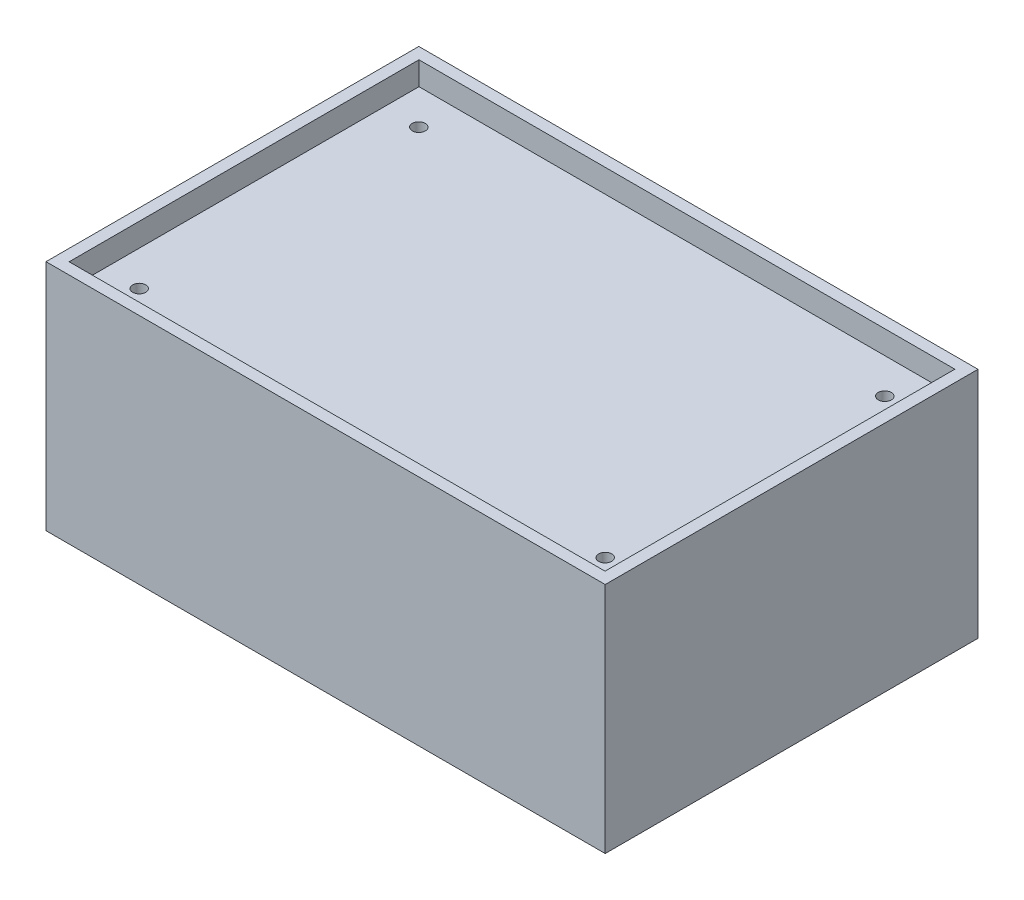
ISO-10303-21;
HEADER;
FILE_DESCRIPTION(('STEP AP214'),'2;1');
FILE_NAME('part.step','',(''),(''),'','','');
FILE_SCHEMA(('AUTOMOTIVE_DESIGN { 1 0 10303 214 1 1 1 1 }'));
ENDSEC;
DATA;
#1=APPLICATION_CONTEXT('core data for automotive mechanical design processes');
#2=APPLICATION_PROTOCOL_DEFINITION('international standard','automotive_design',2000,#1);
#3=PRODUCT_CONTEXT('',#1,'mechanical');
#4=PRODUCT('Part','Part','',(#3));
#5=PRODUCT_RELATED_PRODUCT_CATEGORY('part','',(#4));
#6=PRODUCT_DEFINITION_FORMATION('','',#4);
#7=PRODUCT_DEFINITION_CONTEXT('part definition',#1,'design');
#8=PRODUCT_DEFINITION('design','',#6,#7);
#9=PRODUCT_DEFINITION_SHAPE('','',#8);
#10=(LENGTH_UNIT() NAMED_UNIT(*) SI_UNIT(.MILLI.,.METRE.));
#11=(NAMED_UNIT(*) PLANE_ANGLE_UNIT() SI_UNIT($,.RADIAN.));
#12=(NAMED_UNIT(*) SI_UNIT($,.STERADIAN.) SOLID_ANGLE_UNIT());
#13=UNCERTAINTY_MEASURE_WITH_UNIT(LENGTH_MEASURE(1.E-05),#10,'distance_accuracy_value','');
#14=(GEOMETRIC_REPRESENTATION_CONTEXT(3) GLOBAL_UNCERTAINTY_ASSIGNED_CONTEXT((#13)) GLOBAL_UNIT_ASSIGNED_CONTEXT((#10,
#11,#12)) REPRESENTATION_CONTEXT('',''));
#15=CARTESIAN_POINT('',(0.,0.,0.));
#16=DIRECTION('',(0.,0.,1.));
#17=DIRECTION('',(1.,0.,0.));
#18=AXIS2_PLACEMENT_3D('',#15,#16,#17);
#19=CARTESIAN_POINT('',(-76.2,-31.75,-101.6));
#20=DIRECTION('',(0.,-1.,0.));
#21=DIRECTION('',(0.,0.,-1.));
#22=AXIS2_PLACEMENT_3D('',#19,#20,#21);
#23=PLANE('',#22);
#24=DIRECTION('',(1.,0.,0.));
#25=VECTOR('',#24,1.);
#26=CARTESIAN_POINT('',(-76.2,-31.75,0.));
#27=LINE('',#26,#25);
#28=CARTESIAN_POINT('',(-76.2,-31.75,0.));
#29=VERTEX_POINT('',#28);
#30=CARTESIAN_POINT('',(76.2,-31.75,0.));
#31=VERTEX_POINT('',#30);
#32=EDGE_CURVE('E200',#29,#31,#27,.T.);
#33=ORIENTED_EDGE('',*,*,#32,.F.);
#34=DIRECTION('',(0.,0.,1.));
#35=VECTOR('',#34,1.);
#36=CARTESIAN_POINT('',(-76.2,-31.75,-101.6));
#37=LINE('',#36,#35);
#38=CARTESIAN_POINT('',(-76.2,-31.75,-101.6));
#39=VERTEX_POINT('',#38);
#40=EDGE_CURVE('E42',#39,#29,#37,.T.);
#41=ORIENTED_EDGE('',*,*,#40,.F.);
#42=DIRECTION('',(1.,0.,0.));
#43=VECTOR('',#42,1.);
#44=CARTESIAN_POINT('',(-76.2,-31.75,-101.6));
#45=LINE('',#44,#43);
#46=CARTESIAN_POINT('',(76.2,-31.75,-101.6));
#47=VERTEX_POINT('',#46);
#48=EDGE_CURVE('E206',#39,#47,#45,.T.);
#49=ORIENTED_EDGE('',*,*,#48,.T.);
#50=DIRECTION('',(0.,0.,1.));
#51=VECTOR('',#50,1.);
#52=CARTESIAN_POINT('',(76.2,-31.75,-101.6));
#53=LINE('',#52,#51);
#54=EDGE_CURVE('E11',#47,#31,#53,.T.);
#55=ORIENTED_EDGE('',*,*,#54,.T.);
#56=EDGE_LOOP('',(#33,#41,#49,#55));
#57=FACE_BOUND('',#56,.T.);
#58=DIRECTION('',(-1.,0.,0.));
#59=VECTOR('',#58,1.);
#60=CARTESIAN_POINT('',(-73.025,-31.75,-98.47));
#61=LINE('',#60,#59);
#62=CARTESIAN_POINT('',(73.025,-31.75,-98.47));
#63=VERTEX_POINT('',#62);
#64=CARTESIAN_POINT('',(-73.025,-31.75,-98.47));
#65=VERTEX_POINT('',#64);
#66=EDGE_CURVE('E155',#63,#65,#61,.T.);
#67=ORIENTED_EDGE('',*,*,#66,.T.);
#68=DIRECTION('',(0.,0.,1.));
#69=VECTOR('',#68,1.);
#70=CARTESIAN_POINT('',(-73.025,-31.75,-98.47));
#71=LINE('',#70,#69);
#72=CARTESIAN_POINT('',(-73.025,-31.75,-3.12999999999999));
#73=VERTEX_POINT('',#72);
#74=EDGE_CURVE('E50',#65,#73,#71,.T.);
#75=ORIENTED_EDGE('',*,*,#74,.T.);
#76=DIRECTION('',(1.,0.,0.));
#77=VECTOR('',#76,1.);
#78=CARTESIAN_POINT('',(-73.025,-31.75,-3.12999999999999));
#79=LINE('',#78,#77);
#80=CARTESIAN_POINT('',(73.025,-31.75,-3.12999999999998));
#81=VERTEX_POINT('',#80);
#82=EDGE_CURVE('E143',#73,#81,#79,.T.);
#83=ORIENTED_EDGE('',*,*,#82,.T.);
#84=DIRECTION('',(0.,0.,-1.));
#85=VECTOR('',#84,1.);
#86=CARTESIAN_POINT('',(73.025,-31.75,-98.47));
#87=LINE('',#86,#85);
#88=EDGE_CURVE('E146',#81,#63,#87,.T.);
#89=ORIENTED_EDGE('',*,*,#88,.T.);
#90=EDGE_LOOP('',(#67,#75,#83,#89));
#91=FACE_BOUND('',#90,.T.);
#92=ADVANCED_FACE('F33',(#57,#91),#23,.T.);
#93=CARTESIAN_POINT('',(76.2,31.75,-101.6));
#94=DIRECTION('',(1.,0.,0.));
#95=DIRECTION('',(0.,1.,0.));
#96=AXIS2_PLACEMENT_3D('',#93,#94,#95);
#97=PLANE('',#96);
#98=DIRECTION('',(0.,1.,0.));
#99=VECTOR('',#98,1.);
#100=CARTESIAN_POINT('',(76.2,31.75,0.));
#101=LINE('',#100,#99);
#102=CARTESIAN_POINT('',(76.2,31.75,0.));
#103=VERTEX_POINT('',#102);
#104=EDGE_CURVE('E190',#31,#103,#101,.T.);
#105=ORIENTED_EDGE('',*,*,#104,.F.);
#106=ORIENTED_EDGE('',*,*,#54,.F.);
#107=DIRECTION('',(0.,1.,0.));
#108=VECTOR('',#107,1.);
#109=CARTESIAN_POINT('',(76.2,31.75,-101.6));
#110=LINE('',#109,#108);
#111=CARTESIAN_POINT('',(76.2,31.75,-101.6));
#112=VERTEX_POINT('',#111);
#113=EDGE_CURVE('E196',#47,#112,#110,.T.);
#114=ORIENTED_EDGE('',*,*,#113,.T.);
#115=DIRECTION('',(0.,0.,1.));
#116=VECTOR('',#115,1.);
#117=CARTESIAN_POINT('',(76.2,31.75,-101.6));
#118=LINE('',#117,#116);
#119=EDGE_CURVE('E37',#112,#103,#118,.T.);
#120=ORIENTED_EDGE('',*,*,#119,.T.);
#121=EDGE_LOOP('',(#105,#106,#114,#120));
#122=FACE_BOUND('',#121,.T.);
#123=ADVANCED_FACE('F35',(#122),#97,.T.);
#124=CARTESIAN_POINT('',(-76.2,31.75,-101.6));
#125=DIRECTION('',(-1.,0.,0.));
#126=DIRECTION('',(0.,0.,1.));
#127=AXIS2_PLACEMENT_3D('',#124,#125,#126);
#128=PLANE('',#127);
#129=DIRECTION('',(0.,-1.,0.));
#130=VECTOR('',#129,1.);
#131=CARTESIAN_POINT('',(-76.2,31.75,0.));
#132=LINE('',#131,#130);
#133=CARTESIAN_POINT('',(-76.2,31.75,0.));
#134=VERTEX_POINT('',#133);
#135=EDGE_CURVE('E214',#134,#29,#132,.T.);
#136=ORIENTED_EDGE('',*,*,#135,.F.);
#137=DIRECTION('',(0.,0.,1.));
#138=VECTOR('',#137,1.);
#139=CARTESIAN_POINT('',(-76.2,31.75,-101.6));
#140=LINE('',#139,#138);
#141=CARTESIAN_POINT('',(-76.2,31.75,-101.6));
#142=VERTEX_POINT('',#141);
#143=EDGE_CURVE('E219',#142,#134,#140,.T.);
#144=ORIENTED_EDGE('',*,*,#143,.F.);
#145=DIRECTION('',(0.,-1.,0.));
#146=VECTOR('',#145,1.);
#147=CARTESIAN_POINT('',(-76.2,31.75,-101.6));
#148=LINE('',#147,#146);
#149=EDGE_CURVE('E203',#142,#39,#148,.T.);
#150=ORIENTED_EDGE('',*,*,#149,.T.);
#151=ORIENTED_EDGE('',*,*,#40,.T.);
#152=EDGE_LOOP('',(#136,#144,#150,#151));
#153=FACE_BOUND('',#152,.T.);
#154=ADVANCED_FACE('F238',(#153),#128,.T.);
#155=CARTESIAN_POINT('',(-76.2,31.75,-101.6));
#156=DIRECTION('',(0.,1.,0.));
#157=DIRECTION('',(0.,0.,1.));
#158=AXIS2_PLACEMENT_3D('',#155,#156,#157);
#159=PLANE('',#158);
#160=DIRECTION('',(0.,0.,1.));
#161=VECTOR('',#160,1.);
#162=CARTESIAN_POINT('',(-73.025,31.75,-98.47));
#163=LINE('',#162,#161);
#164=CARTESIAN_POINT('',(-73.025,31.75,-98.47));
#165=VERTEX_POINT('',#164);
#166=CARTESIAN_POINT('',(-73.025,31.75,-3.12999999999999));
#167=VERTEX_POINT('',#166);
#168=EDGE_CURVE('E58',#165,#167,#163,.T.);
#169=ORIENTED_EDGE('',*,*,#168,.F.);
#170=DIRECTION('',(-1.,0.,0.));
#171=VECTOR('',#170,1.);
#172=CARTESIAN_POINT('',(-73.025,31.75,-98.47));
#173=LINE('',#172,#171);
#174=CARTESIAN_POINT('',(73.025,31.75,-98.47));
#175=VERTEX_POINT('',#174);
#176=EDGE_CURVE('E169',#175,#165,#173,.T.);
#177=ORIENTED_EDGE('',*,*,#176,.F.);
#178=DIRECTION('',(0.,0.,-1.));
#179=VECTOR('',#178,1.);
#180=CARTESIAN_POINT('',(73.025,31.75,-98.47));
#181=LINE('',#180,#179);
#182=CARTESIAN_POINT('',(73.025,31.75,-3.12999999999998));
#183=VERTEX_POINT('',#182);
#184=EDGE_CURVE('E183',#183,#175,#181,.T.);
#185=ORIENTED_EDGE('',*,*,#184,.F.);
#186=DIRECTION('',(1.,0.,0.));
#187=VECTOR('',#186,1.);
#188=CARTESIAN_POINT('',(-73.025,31.75,-3.12999999999999));
#189=LINE('',#188,#187);
#190=EDGE_CURVE('E180',#167,#183,#189,.T.);
#191=ORIENTED_EDGE('',*,*,#190,.F.);
#192=EDGE_LOOP('',(#169,#177,#185,#191));
#193=FACE_BOUND('',#192,.T.);
#194=DIRECTION('',(-1.,0.,0.));
#195=VECTOR('',#194,1.);
#196=CARTESIAN_POINT('',(-76.2,31.75,0.));
#197=LINE('',#196,#195);
#198=EDGE_CURVE('E211',#103,#134,#197,.T.);
#199=ORIENTED_EDGE('',*,*,#198,.F.);
#200=ORIENTED_EDGE('',*,*,#119,.F.);
#201=DIRECTION('',(-1.,0.,0.));
#202=VECTOR('',#201,1.);
#203=CARTESIAN_POINT('',(-76.2,31.75,-101.6));
#204=LINE('',#203,#202);
#205=EDGE_CURVE('E199',#112,#142,#204,.T.);
#206=ORIENTED_EDGE('',*,*,#205,.T.);
#207=ORIENTED_EDGE('',*,*,#143,.T.);
#208=EDGE_LOOP('',(#199,#200,#206,#207));
#209=FACE_BOUND('',#208,.T.);
#210=ADVANCED_FACE('F227',(#193,#209),#159,.T.);
#211=CARTESIAN_POINT('',(0.,0.,-101.6));
#212=DIRECTION('',(0.,0.,1.));
#213=DIRECTION('',(1.,0.,0.));
#214=AXIS2_PLACEMENT_3D('',#211,#212,#213);
#215=PLANE('',#214);
#216=ORIENTED_EDGE('',*,*,#113,.F.);
#217=ORIENTED_EDGE('',*,*,#48,.F.);
#218=ORIENTED_EDGE('',*,*,#149,.F.);
#219=ORIENTED_EDGE('',*,*,#205,.F.);
#220=EDGE_LOOP('',(#216,#217,#218,#219));
#221=FACE_BOUND('',#220,.T.);
#222=ADVANCED_FACE('F235',(#221),#215,.F.);
#223=CARTESIAN_POINT('',(0.,0.,0.));
#224=DIRECTION('',(0.,0.,1.));
#225=DIRECTION('',(1.,0.,0.));
#226=AXIS2_PLACEMENT_3D('',#223,#224,#225);
#227=PLANE('',#226);
#228=ORIENTED_EDGE('',*,*,#104,.T.);
#229=ORIENTED_EDGE('',*,*,#198,.T.);
#230=ORIENTED_EDGE('',*,*,#135,.T.);
#231=ORIENTED_EDGE('',*,*,#32,.T.);
#232=EDGE_LOOP('',(#228,#229,#230,#231));
#233=FACE_BOUND('',#232,.T.);
#234=ADVANCED_FACE('F229',(#233),#227,.T.);
#235=CARTESIAN_POINT('',(-73.025,25.4,-98.47));
#236=DIRECTION('',(-1.,0.,0.));
#237=DIRECTION('',(0.,0.,1.));
#238=AXIS2_PLACEMENT_3D('',#235,#236,#237);
#239=PLANE('',#238);
#240=ORIENTED_EDGE('',*,*,#168,.T.);
#241=DIRECTION('',(0.,1.,0.));
#242=VECTOR('',#241,1.);
#243=CARTESIAN_POINT('',(-73.025,25.4,-3.12999999999999));
#244=LINE('',#243,#242);
#245=CARTESIAN_POINT('',(-73.025,25.4,-3.12999999999999));
#246=VERTEX_POINT('',#245);
#247=EDGE_CURVE('E178',#246,#167,#244,.T.);
#248=ORIENTED_EDGE('',*,*,#247,.F.);
#249=DIRECTION('',(0.,0.,1.));
#250=VECTOR('',#249,1.);
#251=CARTESIAN_POINT('',(-73.025,25.4,-98.47));
#252=LINE('',#251,#250);
#253=CARTESIAN_POINT('',(-73.025,25.4,-98.47));
#254=VERTEX_POINT('',#253);
#255=EDGE_CURVE('E165',#254,#246,#252,.T.);
#256=ORIENTED_EDGE('',*,*,#255,.F.);
#257=DIRECTION('',(0.,1.,0.));
#258=VECTOR('',#257,1.);
#259=CARTESIAN_POINT('',(-73.025,25.4,-98.47));
#260=LINE('',#259,#258);
#261=EDGE_CURVE('E188',#254,#165,#260,.T.);
#262=ORIENTED_EDGE('',*,*,#261,.T.);
#263=EDGE_LOOP('',(#240,#248,#256,#262));
#264=FACE_BOUND('',#263,.T.);
#265=ADVANCED_FACE('F253',(#264),#239,.F.);
#266=CARTESIAN_POINT('',(-73.025,25.4,-98.47));
#267=DIRECTION('',(0.,0.,-1.));
#268=DIRECTION('',(-1.,0.,0.));
#269=AXIS2_PLACEMENT_3D('',#266,#267,#268);
#270=PLANE('',#269);
#271=ORIENTED_EDGE('',*,*,#176,.T.);
#272=ORIENTED_EDGE('',*,*,#261,.F.);
#273=DIRECTION('',(-1.,0.,0.));
#274=VECTOR('',#273,1.);
#275=CARTESIAN_POINT('',(-73.025,25.4,-98.47));
#276=LINE('',#275,#274);
#277=CARTESIAN_POINT('',(73.025,25.4,-98.47));
#278=VERTEX_POINT('',#277);
#279=EDGE_CURVE('E175',#278,#254,#276,.T.);
#280=ORIENTED_EDGE('',*,*,#279,.F.);
#281=DIRECTION('',(0.,1.,0.));
#282=VECTOR('',#281,1.);
#283=CARTESIAN_POINT('',(73.025,25.4,-98.47));
#284=LINE('',#283,#282);
#285=EDGE_CURVE('E191',#278,#175,#284,.T.);
#286=ORIENTED_EDGE('',*,*,#285,.T.);
#287=EDGE_LOOP('',(#271,#272,#280,#286));
#288=FACE_BOUND('',#287,.T.);
#289=ADVANCED_FACE('F258',(#288),#270,.F.);
#290=CARTESIAN_POINT('',(73.025,25.4,-98.47));
#291=DIRECTION('',(1.,0.,0.));
#292=DIRECTION('',(0.,0.,-1.));
#293=AXIS2_PLACEMENT_3D('',#290,#291,#292);
#294=PLANE('',#293);
#295=ORIENTED_EDGE('',*,*,#184,.T.);
#296=ORIENTED_EDGE('',*,*,#285,.F.);
#297=DIRECTION('',(0.,0.,-1.));
#298=VECTOR('',#297,1.);
#299=CARTESIAN_POINT('',(73.025,25.4,-98.47));
#300=LINE('',#299,#298);
#301=CARTESIAN_POINT('',(73.025,25.4,-3.12999999999998));
#302=VERTEX_POINT('',#301);
#303=EDGE_CURVE('E172',#302,#278,#300,.T.);
#304=ORIENTED_EDGE('',*,*,#303,.F.);
#305=DIRECTION('',(0.,1.,0.));
#306=VECTOR('',#305,1.);
#307=CARTESIAN_POINT('',(73.025,25.4,-3.12999999999998));
#308=LINE('',#307,#306);
#309=EDGE_CURVE('E193',#302,#183,#308,.T.);
#310=ORIENTED_EDGE('',*,*,#309,.T.);
#311=EDGE_LOOP('',(#295,#296,#304,#310));
#312=FACE_BOUND('',#311,.T.);
#313=ADVANCED_FACE('F263',(#312),#294,.F.);
#314=CARTESIAN_POINT('',(-73.025,25.4,-3.12999999999999));
#315=DIRECTION('',(0.,0.,1.));
#316=DIRECTION('',(1.,0.,0.));
#317=AXIS2_PLACEMENT_3D('',#314,#315,#316);
#318=PLANE('',#317);
#319=ORIENTED_EDGE('',*,*,#190,.T.);
#320=ORIENTED_EDGE('',*,*,#309,.F.);
#321=DIRECTION('',(1.,0.,0.));
#322=VECTOR('',#321,1.);
#323=CARTESIAN_POINT('',(-73.025,25.4,-3.12999999999999));
#324=LINE('',#323,#322);
#325=EDGE_CURVE('E168',#246,#302,#324,.T.);
#326=ORIENTED_EDGE('',*,*,#325,.F.);
#327=ORIENTED_EDGE('',*,*,#247,.T.);
#328=EDGE_LOOP('',(#319,#320,#326,#327));
#329=FACE_BOUND('',#328,.T.);
#330=ADVANCED_FACE('F259',(#329),#318,.F.);
#331=CARTESIAN_POINT('',(0.,25.4,0.));
#332=DIRECTION('',(0.,1.,0.));
#333=DIRECTION('',(0.,0.,1.));
#334=AXIS2_PLACEMENT_3D('',#331,#332,#333);
#335=PLANE('',#334);
#336=CARTESIAN_POINT('',(-63.5,25.4,-12.7));
#337=DIRECTION('',(0.,1.,0.));
#338=DIRECTION('',(0.,0.,1.));
#339=AXIS2_PLACEMENT_3D('',#336,#337,#338);
#340=CIRCLE('',#339,1.78);
#341=CARTESIAN_POINT('',(-63.5,25.4,-10.92));
#342=VERTEX_POINT('',#341);
#343=EDGE_CURVE('E325',#342,#342,#340,.T.);
#344=ORIENTED_EDGE('',*,*,#343,.F.);
#345=EDGE_LOOP('',(#344));
#346=FACE_BOUND('',#345,.T.);
#347=CARTESIAN_POINT('',(-63.5,25.4,-88.9));
#348=DIRECTION('',(0.,1.,0.));
#349=DIRECTION('',(0.,0.,1.));
#350=AXIS2_PLACEMENT_3D('',#347,#348,#349);
#351=CIRCLE('',#350,1.78);
#352=CARTESIAN_POINT('',(-63.5,25.4,-87.12));
#353=VERTEX_POINT('',#352);
#354=EDGE_CURVE('E324',#353,#353,#351,.T.);
#355=ORIENTED_EDGE('',*,*,#354,.F.);
#356=EDGE_LOOP('',(#355));
#357=FACE_BOUND('',#356,.T.);
#358=CARTESIAN_POINT('',(63.5,25.4,-12.7));
#359=DIRECTION('',(0.,1.,0.));
#360=DIRECTION('',(0.,0.,1.));
#361=AXIS2_PLACEMENT_3D('',#358,#359,#360);
#362=CIRCLE('',#361,1.78);
#363=CARTESIAN_POINT('',(63.5,25.4,-10.92));
#364=VERTEX_POINT('',#363);
#365=EDGE_CURVE('E334',#364,#364,#362,.T.);
#366=ORIENTED_EDGE('',*,*,#365,.F.);
#367=EDGE_LOOP('',(#366));
#368=FACE_BOUND('',#367,.T.);
#369=CARTESIAN_POINT('',(63.5,25.4,-88.9));
#370=DIRECTION('',(0.,1.,0.));
#371=DIRECTION('',(0.,0.,1.));
#372=AXIS2_PLACEMENT_3D('',#369,#370,#371);
#373=CIRCLE('',#372,1.78);
#374=CARTESIAN_POINT('',(63.5,25.4,-87.12));
#375=VERTEX_POINT('',#374);
#376=EDGE_CURVE('E149',#375,#375,#373,.T.);
#377=ORIENTED_EDGE('',*,*,#376,.F.);
#378=EDGE_LOOP('',(#377));
#379=FACE_BOUND('',#378,.T.);
#380=ORIENTED_EDGE('',*,*,#255,.T.);
#381=ORIENTED_EDGE('',*,*,#325,.T.);
#382=ORIENTED_EDGE('',*,*,#303,.T.);
#383=ORIENTED_EDGE('',*,*,#279,.T.);
#384=EDGE_LOOP('',(#380,#381,#382,#383));
#385=FACE_BOUND('',#384,.T.);
#386=ADVANCED_FACE('F262',(#346,#357,#368,#379,#385),#335,.T.);
#387=CARTESIAN_POINT('',(-73.025,-25.4,-98.47));
#388=DIRECTION('',(1.,0.,0.));
#389=DIRECTION('',(0.,0.,-1.));
#390=AXIS2_PLACEMENT_3D('',#387,#388,#389);
#391=PLANE('',#390);
#392=ORIENTED_EDGE('',*,*,#74,.F.);
#393=DIRECTION('',(0.,-1.,0.));
#394=VECTOR('',#393,1.);
#395=CARTESIAN_POINT('',(-73.025,-25.4,-98.47));
#396=LINE('',#395,#394);
#397=CARTESIAN_POINT('',(-73.025,-25.4,-98.47));
#398=VERTEX_POINT('',#397);
#399=EDGE_CURVE('E128',#398,#65,#396,.T.);
#400=ORIENTED_EDGE('',*,*,#399,.F.);
#401=DIRECTION('',(0.,0.,1.));
#402=VECTOR('',#401,1.);
#403=CARTESIAN_POINT('',(-73.025,-25.4,-98.47));
#404=LINE('',#403,#402);
#405=CARTESIAN_POINT('',(-73.025,-25.4,-3.12999999999999));
#406=VERTEX_POINT('',#405);
#407=EDGE_CURVE('E135',#398,#406,#404,.T.);
#408=ORIENTED_EDGE('',*,*,#407,.T.);
#409=DIRECTION('',(0.,-1.,0.));
#410=VECTOR('',#409,1.);
#411=CARTESIAN_POINT('',(-73.025,-25.4,-3.12999999999999));
#412=LINE('',#411,#410);
#413=EDGE_CURVE('E160',#406,#73,#412,.T.);
#414=ORIENTED_EDGE('',*,*,#413,.T.);
#415=EDGE_LOOP('',(#392,#400,#408,#414));
#416=FACE_BOUND('',#415,.T.);
#417=ADVANCED_FACE('F138',(#416),#391,.T.);
#418=CARTESIAN_POINT('',(-73.025,-25.4,-3.12999999999999));
#419=DIRECTION('',(0.,0.,-1.));
#420=DIRECTION('',(-1.,0.,0.));
#421=AXIS2_PLACEMENT_3D('',#418,#419,#420);
#422=PLANE('',#421);
#423=ORIENTED_EDGE('',*,*,#82,.F.);
#424=ORIENTED_EDGE('',*,*,#413,.F.);
#425=DIRECTION('',(1.,0.,0.));
#426=VECTOR('',#425,1.);
#427=CARTESIAN_POINT('',(-73.025,-25.4,-3.12999999999999));
#428=LINE('',#427,#426);
#429=CARTESIAN_POINT('',(73.025,-25.4,-3.12999999999998));
#430=VERTEX_POINT('',#429);
#431=EDGE_CURVE('E140',#406,#430,#428,.T.);
#432=ORIENTED_EDGE('',*,*,#431,.T.);
#433=DIRECTION('',(0.,-1.,0.));
#434=VECTOR('',#433,1.);
#435=CARTESIAN_POINT('',(73.025,-25.4,-3.12999999999998));
#436=LINE('',#435,#434);
#437=EDGE_CURVE('E162',#430,#81,#436,.T.);
#438=ORIENTED_EDGE('',*,*,#437,.T.);
#439=EDGE_LOOP('',(#423,#424,#432,#438));
#440=FACE_BOUND('',#439,.T.);
#441=ADVANCED_FACE('F276',(#440),#422,.T.);
#442=CARTESIAN_POINT('',(73.025,-25.4,-98.47));
#443=DIRECTION('',(-1.,0.,0.));
#444=DIRECTION('',(0.,0.,1.));
#445=AXIS2_PLACEMENT_3D('',#442,#443,#444);
#446=PLANE('',#445);
#447=ORIENTED_EDGE('',*,*,#88,.F.);
#448=ORIENTED_EDGE('',*,*,#437,.F.);
#449=DIRECTION('',(0.,0.,-1.));
#450=VECTOR('',#449,1.);
#451=CARTESIAN_POINT('',(73.025,-25.4,-98.47));
#452=LINE('',#451,#450);
#453=CARTESIAN_POINT('',(73.025,-25.4,-98.47));
#454=VERTEX_POINT('',#453);
#455=EDGE_CURVE('E134',#430,#454,#452,.T.);
#456=ORIENTED_EDGE('',*,*,#455,.T.);
#457=DIRECTION('',(0.,-1.,0.));
#458=VECTOR('',#457,1.);
#459=CARTESIAN_POINT('',(73.025,-25.4,-98.47));
#460=LINE('',#459,#458);
#461=EDGE_CURVE('E130',#454,#63,#460,.T.);
#462=ORIENTED_EDGE('',*,*,#461,.T.);
#463=EDGE_LOOP('',(#447,#448,#456,#462));
#464=FACE_BOUND('',#463,.T.);
#465=ADVANCED_FACE('F279',(#464),#446,.T.);
#466=CARTESIAN_POINT('',(-73.025,-25.4,-98.47));
#467=DIRECTION('',(0.,0.,1.));
#468=DIRECTION('',(1.,0.,0.));
#469=AXIS2_PLACEMENT_3D('',#466,#467,#468);
#470=PLANE('',#469);
#471=ORIENTED_EDGE('',*,*,#66,.F.);
#472=ORIENTED_EDGE('',*,*,#461,.F.);
#473=DIRECTION('',(-1.,0.,0.));
#474=VECTOR('',#473,1.);
#475=CARTESIAN_POINT('',(-73.025,-25.4,-98.47));
#476=LINE('',#475,#474);
#477=EDGE_CURVE('E125',#454,#398,#476,.T.);
#478=ORIENTED_EDGE('',*,*,#477,.T.);
#479=ORIENTED_EDGE('',*,*,#399,.T.);
#480=EDGE_LOOP('',(#471,#472,#478,#479));
#481=FACE_BOUND('',#480,.T.);
#482=ADVANCED_FACE('F127',(#481),#470,.T.);
#483=CARTESIAN_POINT('',(0.,-25.4,0.));
#484=DIRECTION('',(0.,-1.,0.));
#485=DIRECTION('',(0.,0.,1.));
#486=AXIS2_PLACEMENT_3D('',#483,#484,#485);
#487=PLANE('',#486);
#488=ORIENTED_EDGE('',*,*,#407,.F.);
#489=ORIENTED_EDGE('',*,*,#477,.F.);
#490=ORIENTED_EDGE('',*,*,#455,.F.);
#491=ORIENTED_EDGE('',*,*,#431,.F.);
#492=EDGE_LOOP('',(#488,#489,#490,#491));
#493=FACE_BOUND('',#492,.T.);
#494=ADVANCED_FACE('F142',(#493),#487,.T.);
#495=CARTESIAN_POINT('',(63.5,15.4,-88.9));
#496=DIRECTION('',(0.,1.,0.));
#497=DIRECTION('',(0.,0.,1.));
#498=AXIS2_PLACEMENT_3D('',#495,#496,#497);
#499=CYLINDRICAL_SURFACE('',#498,1.78);
#500=CARTESIAN_POINT('',(63.5,15.4,-88.9));
#501=DIRECTION('',(0.,1.,0.));
#502=DIRECTION('',(0.,0.,1.));
#503=AXIS2_PLACEMENT_3D('',#500,#501,#502);
#504=CIRCLE('',#503,1.78);
#505=CARTESIAN_POINT('',(63.5,15.4,-87.12));
#506=VERTEX_POINT('',#505);
#507=EDGE_CURVE('E156',#506,#506,#504,.T.);
#508=ORIENTED_EDGE('',*,*,#507,.F.);
#509=EDGE_LOOP('',(#508));
#510=FACE_BOUND('',#509,.T.);
#511=ORIENTED_EDGE('',*,*,#376,.T.);
#512=EDGE_LOOP('',(#511));
#513=FACE_BOUND('',#512,.T.);
#514=ADVANCED_FACE('F288',(#510,#513),#499,.F.);
#515=CARTESIAN_POINT('',(63.5,15.4,-88.9));
#516=DIRECTION('',(0.,1.,0.));
#517=DIRECTION('',(0.,0.,1.));
#518=AXIS2_PLACEMENT_3D('',#515,#516,#517);
#519=PLANE('',#518);
#520=ORIENTED_EDGE('',*,*,#507,.T.);
#521=EDGE_LOOP('',(#520));
#522=FACE_BOUND('',#521,.T.);
#523=ADVANCED_FACE('F291',(#522),#519,.T.);
#524=CARTESIAN_POINT('',(63.5,15.4,-12.7));
#525=DIRECTION('',(0.,1.,0.));
#526=DIRECTION('',(0.,0.,1.));
#527=AXIS2_PLACEMENT_3D('',#524,#525,#526);
#528=CYLINDRICAL_SURFACE('',#527,1.78);
#529=CARTESIAN_POINT('',(63.5,15.4,-12.7));
#530=DIRECTION('',(0.,1.,0.));
#531=DIRECTION('',(0.,0.,1.));
#532=AXIS2_PLACEMENT_3D('',#529,#530,#531);
#533=CIRCLE('',#532,1.78);
#534=CARTESIAN_POINT('',(63.5,15.4,-10.92));
#535=VERTEX_POINT('',#534);
#536=EDGE_CURVE('E336',#535,#535,#533,.T.);
#537=ORIENTED_EDGE('',*,*,#536,.F.);
#538=EDGE_LOOP('',(#537));
#539=FACE_BOUND('',#538,.T.);
#540=ORIENTED_EDGE('',*,*,#365,.T.);
#541=EDGE_LOOP('',(#540));
#542=FACE_BOUND('',#541,.T.);
#543=ADVANCED_FACE('F295',(#539,#542),#528,.F.);
#544=CARTESIAN_POINT('',(63.5,15.4,-12.7));
#545=DIRECTION('',(0.,1.,0.));
#546=DIRECTION('',(0.,0.,1.));
#547=AXIS2_PLACEMENT_3D('',#544,#545,#546);
#548=PLANE('',#547);
#549=ORIENTED_EDGE('',*,*,#536,.T.);
#550=EDGE_LOOP('',(#549));
#551=FACE_BOUND('',#550,.T.);
#552=ADVANCED_FACE('F299',(#551),#548,.T.);
#553=CARTESIAN_POINT('',(-63.5,15.4,-88.9));
#554=DIRECTION('',(0.,1.,0.));
#555=DIRECTION('',(0.,0.,1.));
#556=AXIS2_PLACEMENT_3D('',#553,#554,#555);
#557=CYLINDRICAL_SURFACE('',#556,1.78);
#558=CARTESIAN_POINT('',(-63.5,15.4,-88.9));
#559=DIRECTION('',(0.,1.,0.));
#560=DIRECTION('',(0.,0.,1.));
#561=AXIS2_PLACEMENT_3D('',#558,#559,#560);
#562=CIRCLE('',#561,1.78);
#563=CARTESIAN_POINT('',(-63.5,15.4,-87.12));
#564=VERTEX_POINT('',#563);
#565=EDGE_CURVE('E328',#564,#564,#562,.T.);
#566=ORIENTED_EDGE('',*,*,#565,.F.);
#567=EDGE_LOOP('',(#566));
#568=FACE_BOUND('',#567,.T.);
#569=ORIENTED_EDGE('',*,*,#354,.T.);
#570=EDGE_LOOP('',(#569));
#571=FACE_BOUND('',#570,.T.);
#572=ADVANCED_FACE('F303',(#568,#571),#557,.F.);
#573=CARTESIAN_POINT('',(-63.5,15.4,-88.9));
#574=DIRECTION('',(0.,1.,0.));
#575=DIRECTION('',(0.,0.,1.));
#576=AXIS2_PLACEMENT_3D('',#573,#574,#575);
#577=PLANE('',#576);
#578=ORIENTED_EDGE('',*,*,#565,.T.);
#579=EDGE_LOOP('',(#578));
#580=FACE_BOUND('',#579,.T.);
#581=ADVANCED_FACE('F307',(#580),#577,.T.);
#582=CARTESIAN_POINT('',(-63.5,15.4,-12.7));
#583=DIRECTION('',(0.,1.,0.));
#584=DIRECTION('',(0.,0.,1.));
#585=AXIS2_PLACEMENT_3D('',#582,#583,#584);
#586=CYLINDRICAL_SURFACE('',#585,1.78);
#587=CARTESIAN_POINT('',(-63.5,15.4,-12.7));
#588=DIRECTION('',(0.,1.,0.));
#589=DIRECTION('',(0.,0.,1.));
#590=AXIS2_PLACEMENT_3D('',#587,#588,#589);
#591=CIRCLE('',#590,1.78);
#592=CARTESIAN_POINT('',(-63.5,15.4,-10.92));
#593=VERTEX_POINT('',#592);
#594=EDGE_CURVE('E323',#593,#593,#591,.T.);
#595=ORIENTED_EDGE('',*,*,#594,.F.);
#596=EDGE_LOOP('',(#595));
#597=FACE_BOUND('',#596,.T.);
#598=ORIENTED_EDGE('',*,*,#343,.T.);
#599=EDGE_LOOP('',(#598));
#600=FACE_BOUND('',#599,.T.);
#601=ADVANCED_FACE('F311',(#597,#600),#586,.F.);
#602=CARTESIAN_POINT('',(-63.5,15.4,-12.7));
#603=DIRECTION('',(0.,1.,0.));
#604=DIRECTION('',(0.,0.,1.));
#605=AXIS2_PLACEMENT_3D('',#602,#603,#604);
#606=PLANE('',#605);
#607=ORIENTED_EDGE('',*,*,#594,.T.);
#608=EDGE_LOOP('',(#607));
#609=FACE_BOUND('',#608,.T.);
#610=ADVANCED_FACE('F315',(#609),#606,.T.);
#611=CLOSED_SHELL('',(#92,#123,#154,#210,#222,#234,#265,#289,#313,#330,#386,#417,#441,#465,#482,
#494,#514,#523,#543,#552,#572,#581,#601,#610));
#612=MANIFOLD_SOLID_BREP('B2',#611);
#613=ADVANCED_BREP_SHAPE_REPRESENTATION('',(#18,#612),#14);
#614=SHAPE_DEFINITION_REPRESENTATION(#9,#613);
ENDSEC;
END-ISO-10303-21;
